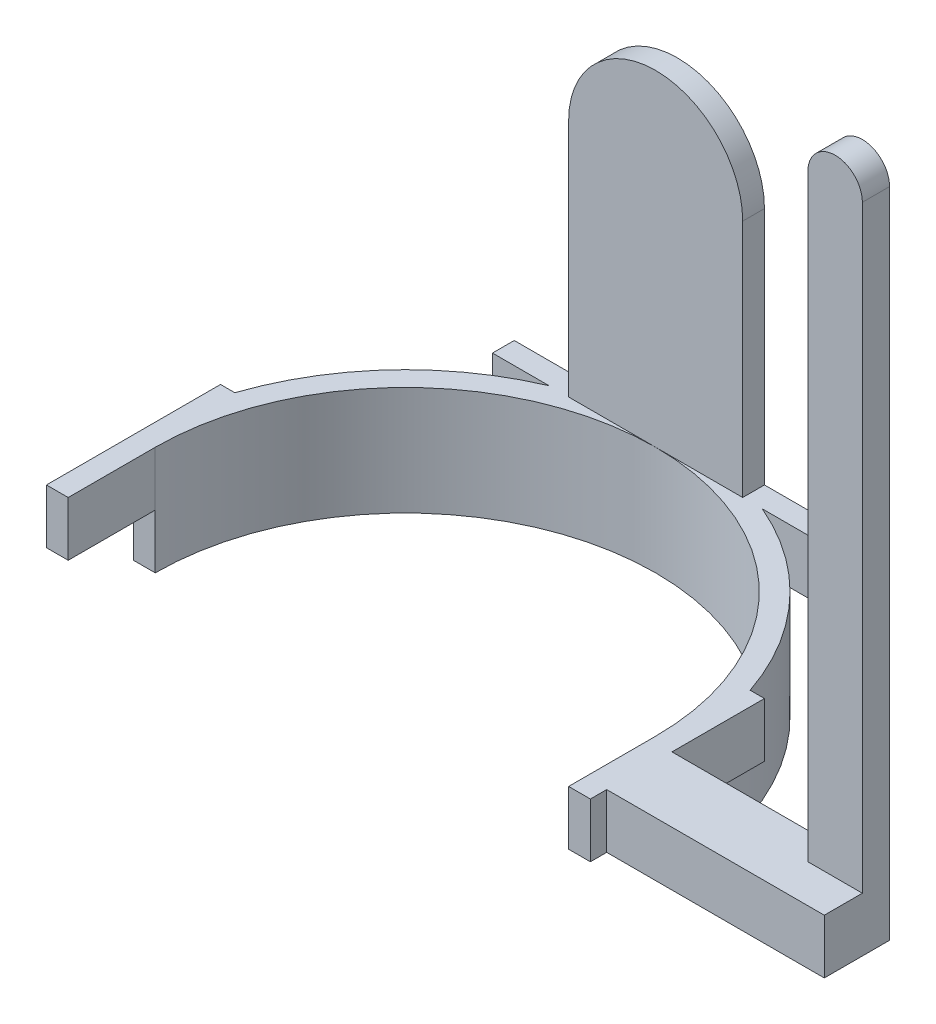
ISO-10303-21;
HEADER;
FILE_DESCRIPTION(('STEP AP214'),'2;1');
FILE_NAME('part.step','',(''),(''),'','','');
FILE_SCHEMA(('AUTOMOTIVE_DESIGN { 1 0 10303 214 1 1 1 1 }'));
ENDSEC;
DATA;
#1=APPLICATION_CONTEXT('core data for automotive mechanical design processes');
#2=APPLICATION_PROTOCOL_DEFINITION('international standard','automotive_design',2000,#1);
#3=PRODUCT_CONTEXT('',#1,'mechanical');
#4=PRODUCT('Part','Part','',(#3));
#5=PRODUCT_RELATED_PRODUCT_CATEGORY('part','',(#4));
#6=PRODUCT_DEFINITION_FORMATION('','',#4);
#7=PRODUCT_DEFINITION_CONTEXT('part definition',#1,'design');
#8=PRODUCT_DEFINITION('design','',#6,#7);
#9=PRODUCT_DEFINITION_SHAPE('','',#8);
#10=(LENGTH_UNIT() NAMED_UNIT(*) SI_UNIT(.MILLI.,.METRE.));
#11=(NAMED_UNIT(*) PLANE_ANGLE_UNIT() SI_UNIT($,.RADIAN.));
#12=(NAMED_UNIT(*) SI_UNIT($,.STERADIAN.) SOLID_ANGLE_UNIT());
#13=UNCERTAINTY_MEASURE_WITH_UNIT(LENGTH_MEASURE(1.E-05),#10,'distance_accuracy_value','');
#14=(GEOMETRIC_REPRESENTATION_CONTEXT(3) GLOBAL_UNCERTAINTY_ASSIGNED_CONTEXT((#13)) GLOBAL_UNIT_ASSIGNED_CONTEXT((#10,
#11,#12)) REPRESENTATION_CONTEXT('',''));
#15=CARTESIAN_POINT('',(0.,0.,0.));
#16=DIRECTION('',(0.,0.,1.));
#17=DIRECTION('',(1.,0.,0.));
#18=AXIS2_PLACEMENT_3D('',#15,#16,#17);
#19=CARTESIAN_POINT('',(0.,20.,0.));
#20=DIRECTION('',(0.,-1.,0.));
#21=DIRECTION('',(0.,0.,-1.));
#22=AXIS2_PLACEMENT_3D('',#19,#20,#21);
#23=PLANE('',#22);
#24=DIRECTION('',(0.,0.,1.));
#25=VECTOR('',#24,1.);
#26=CARTESIAN_POINT('',(80.,20.,1.));
#27=LINE('',#26,#25);
#28=CARTESIAN_POINT('',(80.,20.,1.));
#29=VERTEX_POINT('',#28);
#30=CARTESIAN_POINT('',(80.,20.,6.));
#31=VERTEX_POINT('',#30);
#32=EDGE_CURVE('E267',#29,#31,#27,.T.);
#33=ORIENTED_EDGE('',*,*,#32,.F.);
#34=DIRECTION('',(-1.,0.,0.));
#35=VECTOR('',#34,1.);
#36=CARTESIAN_POINT('',(90.,20.,0.999999999999999));
#37=LINE('',#36,#35);
#38=CARTESIAN_POINT('',(50.,20.,1.));
#39=VERTEX_POINT('',#38);
#40=EDGE_CURVE('E63',#29,#39,#37,.T.);
#41=ORIENTED_EDGE('',*,*,#40,.T.);
#42=DIRECTION('',(0.,0.,-1.));
#43=VECTOR('',#42,1.);
#44=CARTESIAN_POINT('',(50.,20.,-16.));
#45=LINE('',#44,#43);
#46=CARTESIAN_POINT('',(50.,20.,-16.));
#47=VERTEX_POINT('',#46);
#48=EDGE_CURVE('E344',#39,#47,#45,.T.);
#49=ORIENTED_EDGE('',*,*,#48,.T.);
#50=DIRECTION('',(-1.,0.,0.));
#51=VECTOR('',#50,1.);
#52=CARTESIAN_POINT('',(50.,20.,-16.));
#53=LINE('',#52,#51);
#54=CARTESIAN_POINT('',(47.370877129308,20.,-16.));
#55=VERTEX_POINT('',#54);
#56=EDGE_CURVE('E348',#47,#55,#53,.T.);
#57=ORIENTED_EDGE('',*,*,#56,.T.);
#58=CARTESIAN_POINT('',(0.,20.,0.));
#59=DIRECTION('',(0.,1.,0.));
#60=DIRECTION('',(0.,0.,-1.));
#61=AXIS2_PLACEMENT_3D('',#58,#59,#60);
#62=CIRCLE('',#61,50.);
#63=CARTESIAN_POINT('',(19.5959179422654,20.,-46.));
#64=VERTEX_POINT('',#63);
#65=EDGE_CURVE('E350',#55,#64,#62,.T.);
#66=ORIENTED_EDGE('',*,*,#65,.T.);
#67=DIRECTION('',(1.,0.,0.));
#68=VECTOR('',#67,1.);
#69=CARTESIAN_POINT('',(19.5959179422654,20.,-46.));
#70=LINE('',#69,#68);
#71=CARTESIAN_POINT('',(30.,20.,-46.));
#72=VERTEX_POINT('',#71);
#73=EDGE_CURVE('E352',#64,#72,#70,.T.);
#74=ORIENTED_EDGE('',*,*,#73,.T.);
#75=DIRECTION('',(0.,0.,-1.));
#76=VECTOR('',#75,1.);
#77=CARTESIAN_POINT('',(30.,20.,-50.));
#78=LINE('',#77,#76);
#79=CARTESIAN_POINT('',(30.,20.,-50.));
#80=VERTEX_POINT('',#79);
#81=EDGE_CURVE('E354',#72,#80,#78,.T.);
#82=ORIENTED_EDGE('',*,*,#81,.T.);
#83=DIRECTION('',(-1.,0.,0.));
#84=VECTOR('',#83,1.);
#85=CARTESIAN_POINT('',(-30.,20.,-50.));
#86=LINE('',#85,#84);
#87=CARTESIAN_POINT('',(16.,20.,-50.));
#88=VERTEX_POINT('',#87);
#89=EDGE_CURVE('E357',#80,#88,#86,.T.);
#90=ORIENTED_EDGE('',*,*,#89,.T.);
#91=DIRECTION('',(0.,0.,-1.));
#92=VECTOR('',#91,1.);
#93=CARTESIAN_POINT('',(16.,20.,-50.));
#94=LINE('',#93,#92);
#95=CARTESIAN_POINT('',(16.,20.,-46.));
#96=VERTEX_POINT('',#95);
#97=EDGE_CURVE('E312',#96,#88,#94,.T.);
#98=ORIENTED_EDGE('',*,*,#97,.F.);
#99=DIRECTION('',(1.,0.,0.));
#100=VECTOR('',#99,1.);
#101=CARTESIAN_POINT('',(-16.,20.,-46.));
#102=LINE('',#101,#100);
#103=CARTESIAN_POINT('',(0.,20.,-46.));
#104=VERTEX_POINT('',#103);
#105=EDGE_CURVE('E11',#104,#96,#102,.T.);
#106=ORIENTED_EDGE('',*,*,#105,.F.);
#107=CARTESIAN_POINT('',(0.,20.,0.));
#108=DIRECTION('',(0.,-1.,0.));
#109=DIRECTION('',(0.,0.,-1.));
#110=AXIS2_PLACEMENT_3D('',#107,#108,#109);
#111=CIRCLE('',#110,46.);
#112=CARTESIAN_POINT('',(46.,20.,0.));
#113=VERTEX_POINT('',#112);
#114=EDGE_CURVE('E336',#104,#113,#111,.T.);
#115=ORIENTED_EDGE('',*,*,#114,.T.);
#116=DIRECTION('',(0.,0.,1.));
#117=VECTOR('',#116,1.);
#118=CARTESIAN_POINT('',(46.,20.,0.));
#119=LINE('',#118,#117);
#120=CARTESIAN_POINT('',(46.,20.,16.));
#121=VERTEX_POINT('',#120);
#122=EDGE_CURVE('E340',#113,#121,#119,.T.);
#123=ORIENTED_EDGE('',*,*,#122,.T.);
#124=DIRECTION('',(1.,0.,0.));
#125=VECTOR('',#124,1.);
#126=CARTESIAN_POINT('',(50.,20.,16.));
#127=LINE('',#126,#125);
#128=CARTESIAN_POINT('',(50.,20.,16.));
#129=VERTEX_POINT('',#128);
#130=EDGE_CURVE('E342',#121,#129,#127,.T.);
#131=ORIENTED_EDGE('',*,*,#130,.T.);
#132=CARTESIAN_POINT('',(50.,20.,13.));
#133=VERTEX_POINT('',#132);
#134=EDGE_CURVE('E345',#129,#133,#45,.T.);
#135=ORIENTED_EDGE('',*,*,#134,.T.);
#136=DIRECTION('',(-1.,0.,0.));
#137=VECTOR('',#136,1.);
#138=CARTESIAN_POINT('',(90.,20.,13.));
#139=LINE('',#138,#137);
#140=CARTESIAN_POINT('',(90.,20.,13.));
#141=VERTEX_POINT('',#140);
#142=EDGE_CURVE('E286',#141,#133,#139,.T.);
#143=ORIENTED_EDGE('',*,*,#142,.F.);
#144=DIRECTION('',(0.,0.,1.));
#145=VECTOR('',#144,1.);
#146=CARTESIAN_POINT('',(90.,20.,13.));
#147=LINE('',#146,#145);
#148=CARTESIAN_POINT('',(90.,20.,6.));
#149=VERTEX_POINT('',#148);
#150=EDGE_CURVE('E284',#149,#141,#147,.T.);
#151=ORIENTED_EDGE('',*,*,#150,.F.);
#152=DIRECTION('',(1.,0.,0.));
#153=VECTOR('',#152,1.);
#154=CARTESIAN_POINT('',(90.,20.,6.));
#155=LINE('',#154,#153);
#156=EDGE_CURVE('E270',#31,#149,#155,.T.);
#157=ORIENTED_EDGE('',*,*,#156,.F.);
#158=EDGE_LOOP('',(#33,#41,#49,#57,#66,#74,#82,#90,#98,#106,#115,#123,#131,#135,#143,#151,#157));
#159=FACE_BOUND('',#158,.T.);
#160=ADVANCED_FACE('F38',(#159),#23,.F.);
#161=CARTESIAN_POINT('',(50.,20.,-16.));
#162=DIRECTION('',(-1.,0.,0.));
#163=DIRECTION('',(0.,0.,1.));
#164=AXIS2_PLACEMENT_3D('',#161,#162,#163);
#165=PLANE('',#164);
#166=DIRECTION('',(0.,-1.,0.));
#167=VECTOR('',#166,1.);
#168=CARTESIAN_POINT('',(50.,20.,13.));
#169=LINE('',#168,#167);
#170=CARTESIAN_POINT('',(50.,10.,13.));
#171=VERTEX_POINT('',#170);
#172=EDGE_CURVE('E261',#133,#171,#169,.T.);
#173=ORIENTED_EDGE('',*,*,#172,.F.);
#174=ORIENTED_EDGE('',*,*,#134,.F.);
#175=DIRECTION('',(0.,-1.,0.));
#176=VECTOR('',#175,1.);
#177=CARTESIAN_POINT('',(50.,20.,16.));
#178=LINE('',#177,#176);
#179=CARTESIAN_POINT('',(50.,10.,16.));
#180=VERTEX_POINT('',#179);
#181=EDGE_CURVE('E421',#129,#180,#178,.T.);
#182=ORIENTED_EDGE('',*,*,#181,.T.);
#183=DIRECTION('',(0.,0.,-1.));
#184=VECTOR('',#183,1.);
#185=CARTESIAN_POINT('',(50.,10.,-16.));
#186=LINE('',#185,#184);
#187=EDGE_CURVE('E380',#180,#171,#186,.T.);
#188=ORIENTED_EDGE('',*,*,#187,.T.);
#189=EDGE_LOOP('',(#173,#174,#182,#188));
#190=FACE_BOUND('',#189,.T.);
#191=ADVANCED_FACE('F507',(#190),#165,.F.);
#192=DIRECTION('',(0.,1.,0.));
#193=VECTOR('',#192,1.);
#194=CARTESIAN_POINT('',(50.,20.,0.999999999999999));
#195=LINE('',#194,#193);
#196=CARTESIAN_POINT('',(50.,10.,0.999999999999997));
#197=VERTEX_POINT('',#196);
#198=EDGE_CURVE('E280',#197,#39,#195,.T.);
#199=ORIENTED_EDGE('',*,*,#198,.F.);
#200=CARTESIAN_POINT('',(50.,10.,0.));
#201=VERTEX_POINT('',#200);
#202=EDGE_CURVE('E383',#197,#201,#186,.T.);
#203=ORIENTED_EDGE('',*,*,#202,.T.);
#204=CARTESIAN_POINT('',(50.,10.,-16.));
#205=VERTEX_POINT('',#204);
#206=EDGE_CURVE('E379',#201,#205,#186,.T.);
#207=ORIENTED_EDGE('',*,*,#206,.T.);
#208=DIRECTION('',(0.,-1.,0.));
#209=VECTOR('',#208,1.);
#210=CARTESIAN_POINT('',(50.,20.,-16.));
#211=LINE('',#210,#209);
#212=EDGE_CURVE('E418',#47,#205,#211,.T.);
#213=ORIENTED_EDGE('',*,*,#212,.F.);
#214=ORIENTED_EDGE('',*,*,#48,.F.);
#215=EDGE_LOOP('',(#199,#203,#207,#213,#214));
#216=FACE_BOUND('',#215,.T.);
#217=ADVANCED_FACE('F521',(#216),#165,.F.);
#218=CARTESIAN_POINT('',(-16.,80.,-50.));
#219=DIRECTION('',(1.,0.,0.));
#220=DIRECTION('',(0.,0.,-1.));
#221=AXIS2_PLACEMENT_3D('',#218,#219,#220);
#222=PLANE('',#221);
#223=DIRECTION('',(0.,0.,-1.));
#224=VECTOR('',#223,1.);
#225=CARTESIAN_POINT('',(-16.,64.,-20.));
#226=LINE('',#225,#224);
#227=CARTESIAN_POINT('',(-16.,64.,-46.));
#228=VERTEX_POINT('',#227);
#229=CARTESIAN_POINT('',(-16.,64.,-50.));
#230=VERTEX_POINT('',#229);
#231=EDGE_CURVE('E301',#228,#230,#226,.T.);
#232=ORIENTED_EDGE('',*,*,#231,.T.);
#233=DIRECTION('',(0.,-1.,0.));
#234=VECTOR('',#233,1.);
#235=CARTESIAN_POINT('',(-16.,80.,-50.));
#236=LINE('',#235,#234);
#237=CARTESIAN_POINT('',(-16.,20.,-50.));
#238=VERTEX_POINT('',#237);
#239=EDGE_CURVE('E315',#230,#238,#236,.T.);
#240=ORIENTED_EDGE('',*,*,#239,.T.);
#241=DIRECTION('',(0.,0.,1.));
#242=VECTOR('',#241,1.);
#243=CARTESIAN_POINT('',(-16.,20.,-50.));
#244=LINE('',#243,#242);
#245=CARTESIAN_POINT('',(-16.,20.,-46.));
#246=VERTEX_POINT('',#245);
#247=EDGE_CURVE('E308',#238,#246,#244,.T.);
#248=ORIENTED_EDGE('',*,*,#247,.T.);
#249=DIRECTION('',(0.,-1.,0.));
#250=VECTOR('',#249,1.);
#251=CARTESIAN_POINT('',(-16.,80.,-46.));
#252=LINE('',#251,#250);
#253=EDGE_CURVE('E321',#228,#246,#252,.T.);
#254=ORIENTED_EDGE('',*,*,#253,.F.);
#255=EDGE_LOOP('',(#232,#240,#248,#254));
#256=FACE_BOUND('',#255,.T.);
#257=ADVANCED_FACE('F563',(#256),#222,.F.);
#258=ORIENTED_EDGE('',*,*,#247,.F.);
#259=CARTESIAN_POINT('',(-30.,20.,-50.));
#260=VERTEX_POINT('',#259);
#261=EDGE_CURVE('E356',#238,#260,#86,.T.);
#262=ORIENTED_EDGE('',*,*,#261,.T.);
#263=DIRECTION('',(0.,0.,1.));
#264=VECTOR('',#263,1.);
#265=CARTESIAN_POINT('',(-30.,20.,-50.));
#266=LINE('',#265,#264);
#267=CARTESIAN_POINT('',(-30.,20.,-46.));
#268=VERTEX_POINT('',#267);
#269=EDGE_CURVE('E360',#260,#268,#266,.T.);
#270=ORIENTED_EDGE('',*,*,#269,.T.);
#271=DIRECTION('',(1.,0.,0.));
#272=VECTOR('',#271,1.);
#273=CARTESIAN_POINT('',(-30.,20.,-46.));
#274=LINE('',#273,#272);
#275=CARTESIAN_POINT('',(-19.5959179422654,20.,-46.));
#276=VERTEX_POINT('',#275);
#277=EDGE_CURVE('E362',#268,#276,#274,.T.);
#278=ORIENTED_EDGE('',*,*,#277,.T.);
#279=CARTESIAN_POINT('',(0.,20.,0.));
#280=DIRECTION('',(0.,1.,0.));
#281=DIRECTION('',(0.,0.,-1.));
#282=AXIS2_PLACEMENT_3D('',#279,#280,#281);
#283=CIRCLE('',#282,50.);
#284=CARTESIAN_POINT('',(-47.370877129308,20.,-16.));
#285=VERTEX_POINT('',#284);
#286=EDGE_CURVE('E324',#276,#285,#283,.T.);
#287=ORIENTED_EDGE('',*,*,#286,.T.);
#288=DIRECTION('',(-1.,0.,0.));
#289=VECTOR('',#288,1.);
#290=CARTESIAN_POINT('',(-50.,20.,-16.));
#291=LINE('',#290,#289);
#292=CARTESIAN_POINT('',(-50.,20.,-16.));
#293=VERTEX_POINT('',#292);
#294=EDGE_CURVE('E327',#285,#293,#291,.T.);
#295=ORIENTED_EDGE('',*,*,#294,.T.);
#296=DIRECTION('',(0.,0.,1.));
#297=VECTOR('',#296,1.);
#298=CARTESIAN_POINT('',(-50.,20.,-16.));
#299=LINE('',#298,#297);
#300=CARTESIAN_POINT('',(-50.,20.,16.));
#301=VERTEX_POINT('',#300);
#302=EDGE_CURVE('E330',#293,#301,#299,.T.);
#303=ORIENTED_EDGE('',*,*,#302,.T.);
#304=DIRECTION('',(1.,0.,0.));
#305=VECTOR('',#304,1.);
#306=CARTESIAN_POINT('',(-50.,20.,16.));
#307=LINE('',#306,#305);
#308=CARTESIAN_POINT('',(-46.,20.,16.));
#309=VERTEX_POINT('',#308);
#310=EDGE_CURVE('E332',#301,#309,#307,.T.);
#311=ORIENTED_EDGE('',*,*,#310,.T.);
#312=DIRECTION('',(0.,0.,-1.));
#313=VECTOR('',#312,1.);
#314=CARTESIAN_POINT('',(-46.,20.,0.));
#315=LINE('',#314,#313);
#316=CARTESIAN_POINT('',(-46.,20.,0.));
#317=VERTEX_POINT('',#316);
#318=EDGE_CURVE('E334',#309,#317,#315,.T.);
#319=ORIENTED_EDGE('',*,*,#318,.T.);
#320=EDGE_CURVE('E337',#317,#104,#111,.T.);
#321=ORIENTED_EDGE('',*,*,#320,.T.);
#322=EDGE_CURVE('E48',#246,#104,#102,.T.);
#323=ORIENTED_EDGE('',*,*,#322,.F.);
#324=EDGE_LOOP('',(#258,#262,#270,#278,#287,#295,#303,#311,#319,#321,#323));
#325=FACE_BOUND('',#324,.T.);
#326=ADVANCED_FACE('F559',(#325),#23,.F.);
#327=CARTESIAN_POINT('',(0.,10.,0.));
#328=DIRECTION('',(0.,-1.,0.));
#329=DIRECTION('',(0.,0.,-1.));
#330=AXIS2_PLACEMENT_3D('',#327,#328,#329);
#331=CYLINDRICAL_SURFACE('',#330,50.);
#332=CARTESIAN_POINT('',(0.,0.,0.));
#333=DIRECTION('',(0.,1.,0.));
#334=DIRECTION('',(0.,0.,-1.));
#335=AXIS2_PLACEMENT_3D('',#332,#333,#334);
#336=CIRCLE('',#335,50.);
#337=CARTESIAN_POINT('',(50.,0.,0.));
#338=VERTEX_POINT('',#337);
#339=CARTESIAN_POINT('',(-50.,0.,0.));
#340=VERTEX_POINT('',#339);
#341=EDGE_CURVE('E445',#338,#340,#336,.T.);
#342=ORIENTED_EDGE('',*,*,#341,.T.);
#343=DIRECTION('',(0.,-1.,0.));
#344=VECTOR('',#343,1.);
#345=CARTESIAN_POINT('',(-50.,10.,0.));
#346=LINE('',#345,#344);
#347=CARTESIAN_POINT('',(-50.,10.,0.));
#348=VERTEX_POINT('',#347);
#349=EDGE_CURVE('E42',#348,#340,#346,.T.);
#350=ORIENTED_EDGE('',*,*,#349,.F.);
#351=CARTESIAN_POINT('',(0.,10.,0.));
#352=DIRECTION('',(0.,1.,0.));
#353=DIRECTION('',(0.,0.,-1.));
#354=AXIS2_PLACEMENT_3D('',#351,#352,#353);
#355=CIRCLE('',#354,50.);
#356=CARTESIAN_POINT('',(-47.370877129308,10.,-16.));
#357=VERTEX_POINT('',#356);
#358=EDGE_CURVE('E450',#357,#348,#355,.T.);
#359=ORIENTED_EDGE('',*,*,#358,.F.);
#360=DIRECTION('',(0.,-1.,0.));
#361=VECTOR('',#360,1.);
#362=CARTESIAN_POINT('',(-47.370877129308,20.,-16.));
#363=LINE('',#362,#361);
#364=EDGE_CURVE('E442',#285,#357,#363,.T.);
#365=ORIENTED_EDGE('',*,*,#364,.F.);
#366=ORIENTED_EDGE('',*,*,#286,.F.);
#367=DIRECTION('',(0.,-1.,0.));
#368=VECTOR('',#367,1.);
#369=CARTESIAN_POINT('',(-19.5959179422654,20.,-46.));
#370=LINE('',#369,#368);
#371=CARTESIAN_POINT('',(-19.5959179422654,10.,-46.));
#372=VERTEX_POINT('',#371);
#373=EDGE_CURVE('E364',#276,#372,#370,.T.);
#374=ORIENTED_EDGE('',*,*,#373,.T.);
#375=CARTESIAN_POINT('',(0.,10.,-50.));
#376=VERTEX_POINT('',#375);
#377=EDGE_CURVE('E602',#376,#372,#355,.T.);
#378=ORIENTED_EDGE('',*,*,#377,.F.);
#379=CARTESIAN_POINT('',(19.5959179422654,10.,-46.));
#380=VERTEX_POINT('',#379);
#381=EDGE_CURVE('E449',#380,#376,#355,.T.);
#382=ORIENTED_EDGE('',*,*,#381,.F.);
#383=DIRECTION('',(0.,-1.,0.));
#384=VECTOR('',#383,1.);
#385=CARTESIAN_POINT('',(19.5959179422654,20.,-46.));
#386=LINE('',#385,#384);
#387=EDGE_CURVE('E412',#64,#380,#386,.T.);
#388=ORIENTED_EDGE('',*,*,#387,.F.);
#389=ORIENTED_EDGE('',*,*,#65,.F.);
#390=DIRECTION('',(0.,-1.,0.));
#391=VECTOR('',#390,1.);
#392=CARTESIAN_POINT('',(47.370877129308,20.,-16.));
#393=LINE('',#392,#391);
#394=CARTESIAN_POINT('',(47.370877129308,10.,-16.));
#395=VERTEX_POINT('',#394);
#396=EDGE_CURVE('E415',#55,#395,#393,.T.);
#397=ORIENTED_EDGE('',*,*,#396,.T.);
#398=EDGE_CURVE('E446',#201,#395,#355,.T.);
#399=ORIENTED_EDGE('',*,*,#398,.F.);
#400=DIRECTION('',(0.,-1.,0.));
#401=VECTOR('',#400,1.);
#402=CARTESIAN_POINT('',(50.,10.,0.));
#403=LINE('',#402,#401);
#404=EDGE_CURVE('E456',#201,#338,#403,.T.);
#405=ORIENTED_EDGE('',*,*,#404,.T.);
#406=EDGE_LOOP('',(#342,#350,#359,#365,#366,#374,#378,#382,#388,#389,#397,#399,#405));
#407=FACE_BOUND('',#406,.T.);
#408=ADVANCED_FACE('F40',(#407),#331,.T.);
#409=CARTESIAN_POINT('',(-50.,10.,0.));
#410=DIRECTION('',(0.,0.,-1.));
#411=DIRECTION('',(-1.,0.,0.));
#412=AXIS2_PLACEMENT_3D('',#409,#410,#411);
#413=PLANE('',#412);
#414=DIRECTION('',(1.,0.,0.));
#415=VECTOR('',#414,1.);
#416=CARTESIAN_POINT('',(-50.,0.,0.));
#417=LINE('',#416,#415);
#418=CARTESIAN_POINT('',(-46.,0.,0.));
#419=VERTEX_POINT('',#418);
#420=EDGE_CURVE('E459',#340,#419,#417,.T.);
#421=ORIENTED_EDGE('',*,*,#420,.T.);
#422=DIRECTION('',(0.,-1.,0.));
#423=VECTOR('',#422,1.);
#424=CARTESIAN_POINT('',(-46.,10.,0.));
#425=LINE('',#424,#423);
#426=CARTESIAN_POINT('',(-46.,10.,0.));
#427=VERTEX_POINT('',#426);
#428=EDGE_CURVE('E469',#427,#419,#425,.T.);
#429=ORIENTED_EDGE('',*,*,#428,.F.);
#430=DIRECTION('',(1.,0.,0.));
#431=VECTOR('',#430,1.);
#432=CARTESIAN_POINT('',(-50.,10.,0.));
#433=LINE('',#432,#431);
#434=EDGE_CURVE('E448',#348,#427,#433,.T.);
#435=ORIENTED_EDGE('',*,*,#434,.F.);
#436=ORIENTED_EDGE('',*,*,#349,.T.);
#437=EDGE_LOOP('',(#421,#429,#435,#436));
#438=FACE_BOUND('',#437,.T.);
#439=ADVANCED_FACE('F476',(#438),#413,.F.);
#440=CARTESIAN_POINT('',(0.,10.,0.));
#441=DIRECTION('',(0.,-1.,0.));
#442=DIRECTION('',(0.,0.,-1.));
#443=AXIS2_PLACEMENT_3D('',#440,#441,#442);
#444=CYLINDRICAL_SURFACE('',#443,46.);
#445=CARTESIAN_POINT('',(0.,0.,0.));
#446=DIRECTION('',(0.,-1.,0.));
#447=DIRECTION('',(0.,0.,-1.));
#448=AXIS2_PLACEMENT_3D('',#445,#446,#447);
#449=CIRCLE('',#448,46.);
#450=CARTESIAN_POINT('',(46.,0.,0.));
#451=VERTEX_POINT('',#450);
#452=EDGE_CURVE('E461',#419,#451,#449,.T.);
#453=ORIENTED_EDGE('',*,*,#452,.T.);
#454=DIRECTION('',(0.,-1.,0.));
#455=VECTOR('',#454,1.);
#456=CARTESIAN_POINT('',(46.,10.,0.));
#457=LINE('',#456,#455);
#458=CARTESIAN_POINT('',(46.,10.,0.));
#459=VERTEX_POINT('',#458);
#460=EDGE_CURVE('E467',#459,#451,#457,.T.);
#461=ORIENTED_EDGE('',*,*,#460,.F.);
#462=DIRECTION('',(0.,-1.,0.));
#463=VECTOR('',#462,1.);
#464=CARTESIAN_POINT('',(46.,20.,0.));
#465=LINE('',#464,#463);
#466=EDGE_CURVE('E427',#113,#459,#465,.T.);
#467=ORIENTED_EDGE('',*,*,#466,.F.);
#468=ORIENTED_EDGE('',*,*,#114,.F.);
#469=ORIENTED_EDGE('',*,*,#320,.F.);
#470=DIRECTION('',(0.,-1.,0.));
#471=VECTOR('',#470,1.);
#472=CARTESIAN_POINT('',(-46.,20.,0.));
#473=LINE('',#472,#471);
#474=EDGE_CURVE('E430',#317,#427,#473,.T.);
#475=ORIENTED_EDGE('',*,*,#474,.T.);
#476=ORIENTED_EDGE('',*,*,#428,.T.);
#477=EDGE_LOOP('',(#453,#461,#467,#468,#469,#475,#476));
#478=FACE_BOUND('',#477,.T.);
#479=ADVANCED_FACE('F485',(#478),#444,.F.);
#480=CARTESIAN_POINT('',(46.,10.,0.));
#481=DIRECTION('',(0.,0.,-1.));
#482=DIRECTION('',(-1.,0.,0.));
#483=AXIS2_PLACEMENT_3D('',#480,#481,#482);
#484=PLANE('',#483);
#485=DIRECTION('',(1.,0.,0.));
#486=VECTOR('',#485,1.);
#487=CARTESIAN_POINT('',(46.,0.,0.));
#488=LINE('',#487,#486);
#489=EDGE_CURVE('E463',#451,#338,#488,.T.);
#490=ORIENTED_EDGE('',*,*,#489,.T.);
#491=ORIENTED_EDGE('',*,*,#404,.F.);
#492=DIRECTION('',(1.,0.,0.));
#493=VECTOR('',#492,1.);
#494=CARTESIAN_POINT('',(46.,10.,0.));
#495=LINE('',#494,#493);
#496=EDGE_CURVE('E453',#459,#201,#495,.T.);
#497=ORIENTED_EDGE('',*,*,#496,.F.);
#498=ORIENTED_EDGE('',*,*,#460,.T.);
#499=EDGE_LOOP('',(#490,#491,#497,#498));
#500=FACE_BOUND('',#499,.T.);
#501=ADVANCED_FACE('F489',(#500),#484,.F.);
#502=CARTESIAN_POINT('',(0.,0.,0.));
#503=DIRECTION('',(0.,-1.,0.));
#504=DIRECTION('',(0.,0.,-1.));
#505=AXIS2_PLACEMENT_3D('',#502,#503,#504);
#506=PLANE('',#505);
#507=ORIENTED_EDGE('',*,*,#341,.F.);
#508=ORIENTED_EDGE('',*,*,#489,.F.);
#509=ORIENTED_EDGE('',*,*,#452,.F.);
#510=ORIENTED_EDGE('',*,*,#420,.F.);
#511=EDGE_LOOP('',(#507,#508,#509,#510));
#512=FACE_BOUND('',#511,.T.);
#513=ADVANCED_FACE('F484',(#512),#506,.T.);
#514=CARTESIAN_POINT('',(0.,10.,0.));
#515=DIRECTION('',(0.,-1.,0.));
#516=DIRECTION('',(0.,0.,-1.));
#517=AXIS2_PLACEMENT_3D('',#514,#515,#516);
#518=PLANE('',#517);
#519=DIRECTION('',(1.,0.,0.));
#520=VECTOR('',#519,1.);
#521=CARTESIAN_POINT('',(19.5959179422654,10.,-46.));
#522=LINE('',#521,#520);
#523=CARTESIAN_POINT('',(30.,10.,-46.));
#524=VERTEX_POINT('',#523);
#525=EDGE_CURVE('E386',#380,#524,#522,.T.);
#526=ORIENTED_EDGE('',*,*,#525,.F.);
#527=ORIENTED_EDGE('',*,*,#381,.T.);
#528=DIRECTION('',(-1.,0.,0.));
#529=VECTOR('',#528,1.);
#530=CARTESIAN_POINT('',(-30.,10.,-50.));
#531=LINE('',#530,#529);
#532=CARTESIAN_POINT('',(30.,10.,-50.));
#533=VERTEX_POINT('',#532);
#534=EDGE_CURVE('E391',#533,#376,#531,.T.);
#535=ORIENTED_EDGE('',*,*,#534,.F.);
#536=DIRECTION('',(0.,0.,-1.));
#537=VECTOR('',#536,1.);
#538=CARTESIAN_POINT('',(30.,10.,-50.));
#539=LINE('',#538,#537);
#540=EDGE_CURVE('E388',#524,#533,#539,.T.);
#541=ORIENTED_EDGE('',*,*,#540,.F.);
#542=EDGE_LOOP('',(#526,#527,#535,#541));
#543=FACE_BOUND('',#542,.T.);
#544=ADVANCED_FACE('F606',(#543),#518,.T.);
#545=CARTESIAN_POINT('',(-30.,10.,-50.));
#546=VERTEX_POINT('',#545);
#547=EDGE_CURVE('E390',#376,#546,#531,.T.);
#548=ORIENTED_EDGE('',*,*,#547,.F.);
#549=ORIENTED_EDGE('',*,*,#377,.T.);
#550=DIRECTION('',(1.,0.,0.));
#551=VECTOR('',#550,1.);
#552=CARTESIAN_POINT('',(-30.,10.,-46.));
#553=LINE('',#552,#551);
#554=CARTESIAN_POINT('',(-30.,10.,-46.));
#555=VERTEX_POINT('',#554);
#556=EDGE_CURVE('E328',#555,#372,#553,.T.);
#557=ORIENTED_EDGE('',*,*,#556,.F.);
#558=DIRECTION('',(0.,0.,1.));
#559=VECTOR('',#558,1.);
#560=CARTESIAN_POINT('',(-30.,10.,-50.));
#561=LINE('',#560,#559);
#562=EDGE_CURVE('E394',#546,#555,#561,.T.);
#563=ORIENTED_EDGE('',*,*,#562,.F.);
#564=EDGE_LOOP('',(#548,#549,#557,#563));
#565=FACE_BOUND('',#564,.T.);
#566=ADVANCED_FACE('F607',(#565),#518,.T.);
#567=DIRECTION('',(-1.,0.,0.));
#568=VECTOR('',#567,1.);
#569=CARTESIAN_POINT('',(-50.,10.,-16.));
#570=LINE('',#569,#568);
#571=CARTESIAN_POINT('',(-50.,10.,-16.));
#572=VERTEX_POINT('',#571);
#573=EDGE_CURVE('E323',#357,#572,#570,.T.);
#574=ORIENTED_EDGE('',*,*,#573,.F.);
#575=ORIENTED_EDGE('',*,*,#358,.T.);
#576=DIRECTION('',(0.,0.,1.));
#577=VECTOR('',#576,1.);
#578=CARTESIAN_POINT('',(-50.,10.,-16.));
#579=LINE('',#578,#577);
#580=EDGE_CURVE('E367',#572,#348,#579,.T.);
#581=ORIENTED_EDGE('',*,*,#580,.F.);
#582=EDGE_LOOP('',(#574,#575,#581));
#583=FACE_BOUND('',#582,.T.);
#584=ADVANCED_FACE('F601',(#583),#518,.T.);
#585=CARTESIAN_POINT('',(-50.,10.,16.));
#586=VERTEX_POINT('',#585);
#587=EDGE_CURVE('E366',#348,#586,#579,.T.);
#588=ORIENTED_EDGE('',*,*,#587,.F.);
#589=ORIENTED_EDGE('',*,*,#434,.T.);
#590=DIRECTION('',(0.,0.,-1.));
#591=VECTOR('',#590,1.);
#592=CARTESIAN_POINT('',(-46.,10.,0.));
#593=LINE('',#592,#591);
#594=CARTESIAN_POINT('',(-46.,10.,16.));
#595=VERTEX_POINT('',#594);
#596=EDGE_CURVE('E372',#595,#427,#593,.T.);
#597=ORIENTED_EDGE('',*,*,#596,.F.);
#598=DIRECTION('',(1.,0.,0.));
#599=VECTOR('',#598,1.);
#600=CARTESIAN_POINT('',(-50.,10.,16.));
#601=LINE('',#600,#599);
#602=EDGE_CURVE('E370',#586,#595,#601,.T.);
#603=ORIENTED_EDGE('',*,*,#602,.F.);
#604=EDGE_LOOP('',(#588,#589,#597,#603));
#605=FACE_BOUND('',#604,.T.);
#606=ADVANCED_FACE('F599',(#605),#518,.T.);
#607=ORIENTED_EDGE('',*,*,#206,.F.);
#608=ORIENTED_EDGE('',*,*,#398,.T.);
#609=DIRECTION('',(-1.,0.,0.));
#610=VECTOR('',#609,1.);
#611=CARTESIAN_POINT('',(50.,10.,-16.));
#612=LINE('',#611,#610);
#613=EDGE_CURVE('E382',#205,#395,#612,.T.);
#614=ORIENTED_EDGE('',*,*,#613,.F.);
#615=EDGE_LOOP('',(#607,#608,#614));
#616=FACE_BOUND('',#615,.T.);
#617=ADVANCED_FACE('F692',(#616),#518,.T.);
#618=CARTESIAN_POINT('',(-50.,20.,-16.));
#619=DIRECTION('',(0.,0.,1.));
#620=DIRECTION('',(1.,0.,0.));
#621=AXIS2_PLACEMENT_3D('',#618,#619,#620);
#622=PLANE('',#621);
#623=ORIENTED_EDGE('',*,*,#573,.T.);
#624=DIRECTION('',(0.,-1.,0.));
#625=VECTOR('',#624,1.);
#626=CARTESIAN_POINT('',(-50.,20.,-16.));
#627=LINE('',#626,#625);
#628=EDGE_CURVE('E439',#293,#572,#627,.T.);
#629=ORIENTED_EDGE('',*,*,#628,.F.);
#630=ORIENTED_EDGE('',*,*,#294,.F.);
#631=ORIENTED_EDGE('',*,*,#364,.T.);
#632=EDGE_LOOP('',(#623,#629,#630,#631));
#633=FACE_BOUND('',#632,.T.);
#634=ADVANCED_FACE('F582',(#633),#622,.F.);
#635=CARTESIAN_POINT('',(-50.,20.,-16.));
#636=DIRECTION('',(1.,0.,0.));
#637=DIRECTION('',(0.,0.,-1.));
#638=AXIS2_PLACEMENT_3D('',#635,#636,#637);
#639=PLANE('',#638);
#640=ORIENTED_EDGE('',*,*,#580,.T.);
#641=ORIENTED_EDGE('',*,*,#587,.T.);
#642=DIRECTION('',(0.,-1.,0.));
#643=VECTOR('',#642,1.);
#644=CARTESIAN_POINT('',(-50.,20.,16.));
#645=LINE('',#644,#643);
#646=EDGE_CURVE('E436',#301,#586,#645,.T.);
#647=ORIENTED_EDGE('',*,*,#646,.F.);
#648=ORIENTED_EDGE('',*,*,#302,.F.);
#649=ORIENTED_EDGE('',*,*,#628,.T.);
#650=EDGE_LOOP('',(#640,#641,#647,#648,#649));
#651=FACE_BOUND('',#650,.T.);
#652=ADVANCED_FACE('F586',(#651),#639,.F.);
#653=CARTESIAN_POINT('',(-50.,20.,16.));
#654=DIRECTION('',(0.,0.,-1.));
#655=DIRECTION('',(-1.,0.,0.));
#656=AXIS2_PLACEMENT_3D('',#653,#654,#655);
#657=PLANE('',#656);
#658=ORIENTED_EDGE('',*,*,#602,.T.);
#659=DIRECTION('',(0.,-1.,0.));
#660=VECTOR('',#659,1.);
#661=CARTESIAN_POINT('',(-46.,20.,16.));
#662=LINE('',#661,#660);
#663=EDGE_CURVE('E433',#309,#595,#662,.T.);
#664=ORIENTED_EDGE('',*,*,#663,.F.);
#665=ORIENTED_EDGE('',*,*,#310,.F.);
#666=ORIENTED_EDGE('',*,*,#646,.T.);
#667=EDGE_LOOP('',(#658,#664,#665,#666));
#668=FACE_BOUND('',#667,.T.);
#669=ADVANCED_FACE('F592',(#668),#657,.F.);
#670=CARTESIAN_POINT('',(-46.,20.,0.));
#671=DIRECTION('',(-1.,0.,0.));
#672=DIRECTION('',(0.,0.,1.));
#673=AXIS2_PLACEMENT_3D('',#670,#671,#672);
#674=PLANE('',#673);
#675=ORIENTED_EDGE('',*,*,#596,.T.);
#676=ORIENTED_EDGE('',*,*,#474,.F.);
#677=ORIENTED_EDGE('',*,*,#318,.F.);
#678=ORIENTED_EDGE('',*,*,#663,.T.);
#679=EDGE_LOOP('',(#675,#676,#677,#678));
#680=FACE_BOUND('',#679,.T.);
#681=ADVANCED_FACE('F596',(#680),#674,.F.);
#682=CARTESIAN_POINT('',(46.,20.,0.));
#683=DIRECTION('',(1.,0.,0.));
#684=DIRECTION('',(0.,0.,-1.));
#685=AXIS2_PLACEMENT_3D('',#682,#683,#684);
#686=PLANE('',#685);
#687=DIRECTION('',(0.,0.,1.));
#688=VECTOR('',#687,1.);
#689=CARTESIAN_POINT('',(46.,10.,0.));
#690=LINE('',#689,#688);
#691=CARTESIAN_POINT('',(46.,10.,16.));
#692=VERTEX_POINT('',#691);
#693=EDGE_CURVE('E375',#459,#692,#690,.T.);
#694=ORIENTED_EDGE('',*,*,#693,.T.);
#695=DIRECTION('',(0.,-1.,0.));
#696=VECTOR('',#695,1.);
#697=CARTESIAN_POINT('',(46.,20.,16.));
#698=LINE('',#697,#696);
#699=EDGE_CURVE('E424',#121,#692,#698,.T.);
#700=ORIENTED_EDGE('',*,*,#699,.F.);
#701=ORIENTED_EDGE('',*,*,#122,.F.);
#702=ORIENTED_EDGE('',*,*,#466,.T.);
#703=EDGE_LOOP('',(#694,#700,#701,#702));
#704=FACE_BOUND('',#703,.T.);
#705=ADVANCED_FACE('F495',(#704),#686,.F.);
#706=CARTESIAN_POINT('',(50.,20.,16.));
#707=DIRECTION('',(0.,0.,-1.));
#708=DIRECTION('',(-1.,0.,0.));
#709=AXIS2_PLACEMENT_3D('',#706,#707,#708);
#710=PLANE('',#709);
#711=DIRECTION('',(1.,0.,0.));
#712=VECTOR('',#711,1.);
#713=CARTESIAN_POINT('',(50.,10.,16.));
#714=LINE('',#713,#712);
#715=EDGE_CURVE('E377',#692,#180,#714,.T.);
#716=ORIENTED_EDGE('',*,*,#715,.T.);
#717=ORIENTED_EDGE('',*,*,#181,.F.);
#718=ORIENTED_EDGE('',*,*,#130,.F.);
#719=ORIENTED_EDGE('',*,*,#699,.T.);
#720=EDGE_LOOP('',(#716,#717,#718,#719));
#721=FACE_BOUND('',#720,.T.);
#722=ADVANCED_FACE('F503',(#721),#710,.F.);
#723=CARTESIAN_POINT('',(50.,20.,-16.));
#724=DIRECTION('',(0.,0.,1.));
#725=DIRECTION('',(1.,0.,0.));
#726=AXIS2_PLACEMENT_3D('',#723,#724,#725);
#727=PLANE('',#726);
#728=ORIENTED_EDGE('',*,*,#613,.T.);
#729=ORIENTED_EDGE('',*,*,#396,.F.);
#730=ORIENTED_EDGE('',*,*,#56,.F.);
#731=ORIENTED_EDGE('',*,*,#212,.T.);
#732=EDGE_LOOP('',(#728,#729,#730,#731));
#733=FACE_BOUND('',#732,.T.);
#734=ADVANCED_FACE('F528',(#733),#727,.F.);
#735=CARTESIAN_POINT('',(19.5959179422654,20.,-46.));
#736=DIRECTION('',(0.,0.,-1.));
#737=DIRECTION('',(-1.,0.,0.));
#738=AXIS2_PLACEMENT_3D('',#735,#736,#737);
#739=PLANE('',#738);
#740=ORIENTED_EDGE('',*,*,#525,.T.);
#741=DIRECTION('',(0.,-1.,0.));
#742=VECTOR('',#741,1.);
#743=CARTESIAN_POINT('',(30.,20.,-46.));
#744=LINE('',#743,#742);
#745=EDGE_CURVE('E409',#72,#524,#744,.T.);
#746=ORIENTED_EDGE('',*,*,#745,.F.);
#747=ORIENTED_EDGE('',*,*,#73,.F.);
#748=ORIENTED_EDGE('',*,*,#387,.T.);
#749=EDGE_LOOP('',(#740,#746,#747,#748));
#750=FACE_BOUND('',#749,.T.);
#751=ADVANCED_FACE('F535',(#750),#739,.F.);
#752=CARTESIAN_POINT('',(30.,20.,-50.));
#753=DIRECTION('',(-1.,0.,0.));
#754=DIRECTION('',(0.,0.,1.));
#755=AXIS2_PLACEMENT_3D('',#752,#753,#754);
#756=PLANE('',#755);
#757=ORIENTED_EDGE('',*,*,#540,.T.);
#758=DIRECTION('',(0.,-1.,0.));
#759=VECTOR('',#758,1.);
#760=CARTESIAN_POINT('',(30.,20.,-50.));
#761=LINE('',#760,#759);
#762=EDGE_CURVE('E406',#80,#533,#761,.T.);
#763=ORIENTED_EDGE('',*,*,#762,.F.);
#764=ORIENTED_EDGE('',*,*,#81,.F.);
#765=ORIENTED_EDGE('',*,*,#745,.T.);
#766=EDGE_LOOP('',(#757,#763,#764,#765));
#767=FACE_BOUND('',#766,.T.);
#768=ADVANCED_FACE('F541',(#767),#756,.F.);
#769=CARTESIAN_POINT('',(-30.,20.,-50.));
#770=DIRECTION('',(0.,0.,1.));
#771=DIRECTION('',(1.,0.,0.));
#772=AXIS2_PLACEMENT_3D('',#769,#770,#771);
#773=PLANE('',#772);
#774=ORIENTED_EDGE('',*,*,#239,.F.);
#775=CARTESIAN_POINT('',(0.,64.,-50.));
#776=DIRECTION('',(0.,0.,1.));
#777=DIRECTION('',(-1.,0.,0.));
#778=AXIS2_PLACEMENT_3D('',#775,#776,#777);
#779=CIRCLE('',#778,16.);
#780=CARTESIAN_POINT('',(16.,64.,-50.));
#781=VERTEX_POINT('',#780);
#782=EDGE_CURVE('E299',#781,#230,#779,.T.);
#783=ORIENTED_EDGE('',*,*,#782,.F.);
#784=DIRECTION('',(0.,-1.,0.));
#785=VECTOR('',#784,1.);
#786=CARTESIAN_POINT('',(16.,80.,-50.));
#787=LINE('',#786,#785);
#788=EDGE_CURVE('E317',#781,#88,#787,.T.);
#789=ORIENTED_EDGE('',*,*,#788,.T.);
#790=ORIENTED_EDGE('',*,*,#89,.F.);
#791=ORIENTED_EDGE('',*,*,#762,.T.);
#792=ORIENTED_EDGE('',*,*,#534,.T.);
#793=ORIENTED_EDGE('',*,*,#547,.T.);
#794=DIRECTION('',(0.,-1.,0.));
#795=VECTOR('',#794,1.);
#796=CARTESIAN_POINT('',(-30.,20.,-50.));
#797=LINE('',#796,#795);
#798=EDGE_CURVE('E403',#260,#546,#797,.T.);
#799=ORIENTED_EDGE('',*,*,#798,.F.);
#800=ORIENTED_EDGE('',*,*,#261,.F.);
#801=EDGE_LOOP('',(#774,#783,#789,#790,#791,#792,#793,#799,#800));
#802=FACE_BOUND('',#801,.T.);
#803=ADVANCED_FACE('F546',(#802),#773,.F.);
#804=CARTESIAN_POINT('',(-30.,20.,-50.));
#805=DIRECTION('',(1.,0.,0.));
#806=DIRECTION('',(0.,0.,-1.));
#807=AXIS2_PLACEMENT_3D('',#804,#805,#806);
#808=PLANE('',#807);
#809=ORIENTED_EDGE('',*,*,#562,.T.);
#810=DIRECTION('',(0.,-1.,0.));
#811=VECTOR('',#810,1.);
#812=CARTESIAN_POINT('',(-30.,20.,-46.));
#813=LINE('',#812,#811);
#814=EDGE_CURVE('E400',#268,#555,#813,.T.);
#815=ORIENTED_EDGE('',*,*,#814,.F.);
#816=ORIENTED_EDGE('',*,*,#269,.F.);
#817=ORIENTED_EDGE('',*,*,#798,.T.);
#818=EDGE_LOOP('',(#809,#815,#816,#817));
#819=FACE_BOUND('',#818,.T.);
#820=ADVANCED_FACE('F571',(#819),#808,.F.);
#821=CARTESIAN_POINT('',(-30.,20.,-46.));
#822=DIRECTION('',(0.,0.,-1.));
#823=DIRECTION('',(-1.,0.,0.));
#824=AXIS2_PLACEMENT_3D('',#821,#822,#823);
#825=PLANE('',#824);
#826=ORIENTED_EDGE('',*,*,#556,.T.);
#827=ORIENTED_EDGE('',*,*,#373,.F.);
#828=ORIENTED_EDGE('',*,*,#277,.F.);
#829=ORIENTED_EDGE('',*,*,#814,.T.);
#830=EDGE_LOOP('',(#826,#827,#828,#829));
#831=FACE_BOUND('',#830,.T.);
#832=ADVANCED_FACE('F575',(#831),#825,.F.);
#833=ORIENTED_EDGE('',*,*,#693,.F.);
#834=ORIENTED_EDGE('',*,*,#496,.T.);
#835=ORIENTED_EDGE('',*,*,#202,.F.);
#836=DIRECTION('',(-1.,0.,0.));
#837=VECTOR('',#836,1.);
#838=CARTESIAN_POINT('',(90.,10.,0.999999999999997));
#839=LINE('',#838,#837);
#840=CARTESIAN_POINT('',(90.,10.,0.999999999999997));
#841=VERTEX_POINT('',#840);
#842=EDGE_CURVE('E293',#841,#197,#839,.T.);
#843=ORIENTED_EDGE('',*,*,#842,.F.);
#844=DIRECTION('',(0.,0.,-1.));
#845=VECTOR('',#844,1.);
#846=CARTESIAN_POINT('',(90.,10.,13.));
#847=LINE('',#846,#845);
#848=CARTESIAN_POINT('',(90.,10.,13.));
#849=VERTEX_POINT('',#848);
#850=EDGE_CURVE('E279',#849,#841,#847,.T.);
#851=ORIENTED_EDGE('',*,*,#850,.F.);
#852=DIRECTION('',(-1.,0.,0.));
#853=VECTOR('',#852,1.);
#854=CARTESIAN_POINT('',(90.,10.,13.));
#855=LINE('',#854,#853);
#856=EDGE_CURVE('E296',#849,#171,#855,.T.);
#857=ORIENTED_EDGE('',*,*,#856,.T.);
#858=ORIENTED_EDGE('',*,*,#187,.F.);
#859=ORIENTED_EDGE('',*,*,#715,.F.);
#860=EDGE_LOOP('',(#833,#834,#835,#843,#851,#857,#858,#859));
#861=FACE_BOUND('',#860,.T.);
#862=ADVANCED_FACE('F499',(#861),#518,.T.);
#863=CARTESIAN_POINT('',(-16.,80.,-46.));
#864=DIRECTION('',(0.,0.,-1.));
#865=DIRECTION('',(-1.,0.,0.));
#866=AXIS2_PLACEMENT_3D('',#863,#864,#865);
#867=PLANE('',#866);
#868=DIRECTION('',(0.,-1.,0.));
#869=VECTOR('',#868,1.);
#870=CARTESIAN_POINT('',(16.,80.,-46.));
#871=LINE('',#870,#869);
#872=CARTESIAN_POINT('',(16.,64.,-46.));
#873=VERTEX_POINT('',#872);
#874=EDGE_CURVE('E319',#873,#96,#871,.T.);
#875=ORIENTED_EDGE('',*,*,#874,.F.);
#876=CARTESIAN_POINT('',(0.,64.,-46.));
#877=DIRECTION('',(0.,0.,-1.));
#878=DIRECTION('',(-1.,0.,0.));
#879=AXIS2_PLACEMENT_3D('',#876,#877,#878);
#880=CIRCLE('',#879,16.);
#881=EDGE_CURVE('E304',#873,#228,#880,.F.);
#882=ORIENTED_EDGE('',*,*,#881,.T.);
#883=ORIENTED_EDGE('',*,*,#253,.T.);
#884=ORIENTED_EDGE('',*,*,#322,.T.);
#885=ORIENTED_EDGE('',*,*,#105,.T.);
#886=EDGE_LOOP('',(#875,#882,#883,#884,#885));
#887=FACE_BOUND('',#886,.T.);
#888=ADVANCED_FACE('F554',(#887),#867,.F.);
#889=CARTESIAN_POINT('',(16.,80.,-50.));
#890=DIRECTION('',(-1.,0.,0.));
#891=DIRECTION('',(0.,0.,1.));
#892=AXIS2_PLACEMENT_3D('',#889,#890,#891);
#893=PLANE('',#892);
#894=ORIENTED_EDGE('',*,*,#788,.F.);
#895=DIRECTION('',(0.,0.,-1.));
#896=VECTOR('',#895,1.);
#897=CARTESIAN_POINT('',(16.,64.,-20.));
#898=LINE('',#897,#896);
#899=EDGE_CURVE('E302',#873,#781,#898,.T.);
#900=ORIENTED_EDGE('',*,*,#899,.F.);
#901=ORIENTED_EDGE('',*,*,#874,.T.);
#902=ORIENTED_EDGE('',*,*,#97,.T.);
#903=EDGE_LOOP('',(#894,#900,#901,#902));
#904=FACE_BOUND('',#903,.T.);
#905=ADVANCED_FACE('F551',(#904),#893,.F.);
#906=CARTESIAN_POINT('',(0.,64.,-20.));
#907=DIRECTION('',(0.,0.,-1.));
#908=DIRECTION('',(-1.,0.,0.));
#909=AXIS2_PLACEMENT_3D('',#906,#907,#908);
#910=CYLINDRICAL_SURFACE('',#909,16.);
#911=ORIENTED_EDGE('',*,*,#899,.T.);
#912=ORIENTED_EDGE('',*,*,#782,.T.);
#913=ORIENTED_EDGE('',*,*,#231,.F.);
#914=ORIENTED_EDGE('',*,*,#881,.F.);
#915=EDGE_LOOP('',(#911,#912,#913,#914));
#916=FACE_BOUND('',#915,.T.);
#917=ADVANCED_FACE('F635',(#916),#910,.T.);
#918=CARTESIAN_POINT('',(90.,20.,13.));
#919=DIRECTION('',(0.,0.,-1.));
#920=DIRECTION('',(0.,1.,0.));
#921=AXIS2_PLACEMENT_3D('',#918,#919,#920);
#922=PLANE('',#921);
#923=ORIENTED_EDGE('',*,*,#172,.T.);
#924=ORIENTED_EDGE('',*,*,#856,.F.);
#925=DIRECTION('',(0.,-1.,0.));
#926=VECTOR('',#925,1.);
#927=CARTESIAN_POINT('',(90.,20.,13.));
#928=LINE('',#927,#926);
#929=EDGE_CURVE('E276',#141,#849,#928,.T.);
#930=ORIENTED_EDGE('',*,*,#929,.F.);
#931=ORIENTED_EDGE('',*,*,#142,.T.);
#932=EDGE_LOOP('',(#923,#924,#930,#931));
#933=FACE_BOUND('',#932,.T.);
#934=ADVANCED_FACE('F512',(#933),#922,.F.);
#935=CARTESIAN_POINT('',(90.,20.,0.999999999999999));
#936=DIRECTION('',(0.,0.,1.));
#937=DIRECTION('',(0.,-1.,0.));
#938=AXIS2_PLACEMENT_3D('',#935,#936,#937);
#939=PLANE('',#938);
#940=DIRECTION('',(0.,-1.,0.));
#941=VECTOR('',#940,1.);
#942=CARTESIAN_POINT('',(80.,130.,1.));
#943=LINE('',#942,#941);
#944=CARTESIAN_POINT('',(80.,130.,1.00000000000002));
#945=VERTEX_POINT('',#944);
#946=EDGE_CURVE('E246',#945,#29,#943,.T.);
#947=ORIENTED_EDGE('',*,*,#946,.F.);
#948=CARTESIAN_POINT('',(85.,130.,1.00000000000002));
#949=DIRECTION('',(0.,0.,-1.));
#950=DIRECTION('',(0.,1.,0.));
#951=AXIS2_PLACEMENT_3D('',#948,#949,#950);
#952=CIRCLE('',#951,5.00000000000001);
#953=CARTESIAN_POINT('',(90.,130.,0.999999999999999));
#954=VERTEX_POINT('',#953);
#955=EDGE_CURVE('E259',#945,#954,#952,.T.);
#956=ORIENTED_EDGE('',*,*,#955,.T.);
#957=DIRECTION('',(0.,1.,0.));
#958=VECTOR('',#957,1.);
#959=CARTESIAN_POINT('',(90.,20.,0.999999999999999));
#960=LINE('',#959,#958);
#961=EDGE_CURVE('E282',#841,#954,#960,.T.);
#962=ORIENTED_EDGE('',*,*,#961,.F.);
#963=ORIENTED_EDGE('',*,*,#842,.T.);
#964=ORIENTED_EDGE('',*,*,#198,.T.);
#965=ORIENTED_EDGE('',*,*,#40,.F.);
#966=EDGE_LOOP('',(#947,#956,#962,#963,#964,#965));
#967=FACE_BOUND('',#966,.T.);
#968=ADVANCED_FACE('F257',(#967),#939,.F.);
#969=CARTESIAN_POINT('',(90.,0.,0.));
#970=DIRECTION('',(1.,0.,0.));
#971=DIRECTION('',(0.,0.,-1.));
#972=AXIS2_PLACEMENT_3D('',#969,#970,#971);
#973=PLANE('',#972);
#974=ORIENTED_EDGE('',*,*,#929,.T.);
#975=ORIENTED_EDGE('',*,*,#850,.T.);
#976=ORIENTED_EDGE('',*,*,#961,.T.);
#977=DIRECTION('',(0.,0.,-1.));
#978=VECTOR('',#977,1.);
#979=CARTESIAN_POINT('',(90.,130.,0.999999999999999));
#980=LINE('',#979,#978);
#981=CARTESIAN_POINT('',(90.,130.,6.));
#982=VERTEX_POINT('',#981);
#983=EDGE_CURVE('E253',#982,#954,#980,.T.);
#984=ORIENTED_EDGE('',*,*,#983,.F.);
#985=DIRECTION('',(0.,-1.,0.));
#986=VECTOR('',#985,1.);
#987=CARTESIAN_POINT('',(90.,130.,6.));
#988=LINE('',#987,#986);
#989=EDGE_CURVE('E55',#982,#149,#988,.T.);
#990=ORIENTED_EDGE('',*,*,#989,.T.);
#991=ORIENTED_EDGE('',*,*,#150,.T.);
#992=EDGE_LOOP('',(#974,#975,#976,#984,#990,#991));
#993=FACE_BOUND('',#992,.T.);
#994=ADVANCED_FACE('F514',(#993),#973,.T.);
#995=CARTESIAN_POINT('',(80.,130.,1.));
#996=DIRECTION('',(1.,0.,0.));
#997=DIRECTION('',(0.,0.,-1.));
#998=AXIS2_PLACEMENT_3D('',#995,#996,#997);
#999=PLANE('',#998);
#1000=ORIENTED_EDGE('',*,*,#32,.T.);
#1001=DIRECTION('',(0.,-1.,0.));
#1002=VECTOR('',#1001,1.);
#1003=CARTESIAN_POINT('',(80.,130.,6.));
#1004=LINE('',#1003,#1002);
#1005=CARTESIAN_POINT('',(80.,130.,6.));
#1006=VERTEX_POINT('',#1005);
#1007=EDGE_CURVE('E248',#1006,#31,#1004,.T.);
#1008=ORIENTED_EDGE('',*,*,#1007,.F.);
#1009=DIRECTION('',(0.,0.,1.));
#1010=VECTOR('',#1009,1.);
#1011=CARTESIAN_POINT('',(80.,130.,1.));
#1012=LINE('',#1011,#1010);
#1013=EDGE_CURVE('E243',#945,#1006,#1012,.T.);
#1014=ORIENTED_EDGE('',*,*,#1013,.F.);
#1015=ORIENTED_EDGE('',*,*,#946,.T.);
#1016=EDGE_LOOP('',(#1000,#1008,#1014,#1015));
#1017=FACE_BOUND('',#1016,.T.);
#1018=ADVANCED_FACE('F245',(#1017),#999,.F.);
#1019=CARTESIAN_POINT('',(90.,130.,6.));
#1020=DIRECTION('',(0.,0.,-1.));
#1021=DIRECTION('',(-1.,0.,0.));
#1022=AXIS2_PLACEMENT_3D('',#1019,#1020,#1021);
#1023=PLANE('',#1022);
#1024=ORIENTED_EDGE('',*,*,#989,.F.);
#1025=CARTESIAN_POINT('',(85.,130.,6.00000000000002));
#1026=DIRECTION('',(0.,0.,-1.));
#1027=DIRECTION('',(0.,1.,0.));
#1028=AXIS2_PLACEMENT_3D('',#1025,#1026,#1027);
#1029=CIRCLE('',#1028,5.00000000000001);
#1030=EDGE_CURVE('E265',#1006,#982,#1029,.T.);
#1031=ORIENTED_EDGE('',*,*,#1030,.F.);
#1032=ORIENTED_EDGE('',*,*,#1007,.T.);
#1033=ORIENTED_EDGE('',*,*,#156,.T.);
#1034=EDGE_LOOP('',(#1024,#1031,#1032,#1033));
#1035=FACE_BOUND('',#1034,.T.);
#1036=ADVANCED_FACE('F518',(#1035),#1023,.F.);
#1037=CARTESIAN_POINT('',(85.,130.,6.00000000000002));
#1038=DIRECTION('',(0.,0.,-1.));
#1039=DIRECTION('',(0.,1.,0.));
#1040=AXIS2_PLACEMENT_3D('',#1037,#1038,#1039);
#1041=CYLINDRICAL_SURFACE('',#1040,5.00000000000001);
#1042=ORIENTED_EDGE('',*,*,#1013,.T.);
#1043=ORIENTED_EDGE('',*,*,#1030,.T.);
#1044=ORIENTED_EDGE('',*,*,#983,.T.);
#1045=ORIENTED_EDGE('',*,*,#955,.F.);
#1046=EDGE_LOOP('',(#1042,#1043,#1044,#1045));
#1047=FACE_BOUND('',#1046,.T.);
#1048=ADVANCED_FACE('F264',(#1047),#1041,.T.);
#1049=CLOSED_SHELL('',(#160,#191,#217,#257,#326,#408,#439,#479,#501,#513,#544,#566,#584,#606,
#617,#634,#652,#669,#681,#705,#722,#734,#751,#768,#803,#820,#832,#862,#888,#905,#917,#934,#968,
#994,#1018,#1036,#1048));
#1050=MANIFOLD_SOLID_BREP('B2',#1049);
#1051=ADVANCED_BREP_SHAPE_REPRESENTATION('',(#18,#1050),#14);
#1052=SHAPE_DEFINITION_REPRESENTATION(#9,#1051);
ENDSEC;
END-ISO-10303-21;
